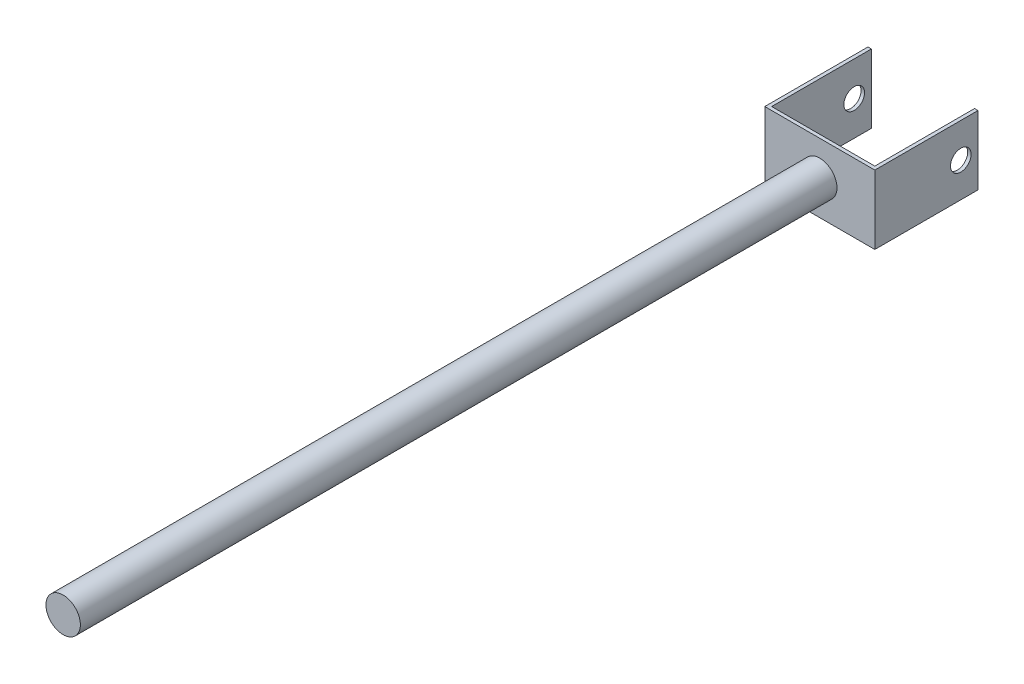
ISO-10303-21;
HEADER;
FILE_DESCRIPTION(('STEP AP214'),'2;1');
FILE_NAME('part.step','',(''),(''),'','','');
FILE_SCHEMA(('AUTOMOTIVE_DESIGN { 1 0 10303 214 1 1 1 1 }'));
ENDSEC;
DATA;
#1=APPLICATION_CONTEXT('core data for automotive mechanical design processes');
#2=APPLICATION_PROTOCOL_DEFINITION('international standard','automotive_design',2000,#1);
#3=PRODUCT_CONTEXT('',#1,'mechanical');
#4=PRODUCT('Part','Part','',(#3));
#5=PRODUCT_RELATED_PRODUCT_CATEGORY('part','',(#4));
#6=PRODUCT_DEFINITION_FORMATION('','',#4);
#7=PRODUCT_DEFINITION_CONTEXT('part definition',#1,'design');
#8=PRODUCT_DEFINITION('design','',#6,#7);
#9=PRODUCT_DEFINITION_SHAPE('','',#8);
#10=(LENGTH_UNIT() NAMED_UNIT(*) SI_UNIT(.MILLI.,.METRE.));
#11=(NAMED_UNIT(*) PLANE_ANGLE_UNIT() SI_UNIT($,.RADIAN.));
#12=(NAMED_UNIT(*) SI_UNIT($,.STERADIAN.) SOLID_ANGLE_UNIT());
#13=UNCERTAINTY_MEASURE_WITH_UNIT(LENGTH_MEASURE(1.E-05),#10,'distance_accuracy_value','');
#14=(GEOMETRIC_REPRESENTATION_CONTEXT(3) GLOBAL_UNCERTAINTY_ASSIGNED_CONTEXT((#13)) GLOBAL_UNIT_ASSIGNED_CONTEXT((#10,
#11,#12)) REPRESENTATION_CONTEXT('',''));
#15=CARTESIAN_POINT('',(0.,0.,0.));
#16=DIRECTION('',(0.,0.,1.));
#17=DIRECTION('',(1.,0.,0.));
#18=AXIS2_PLACEMENT_3D('',#15,#16,#17);
#19=CARTESIAN_POINT('',(0.,50.,0.));
#20=DIRECTION('',(1.,0.,0.));
#21=DIRECTION('',(0.,0.,-1.));
#22=AXIS2_PLACEMENT_3D('',#19,#20,#21);
#23=PLANE('',#22);
#24=CARTESIAN_POINT('',(0.,0.,-125.));
#25=DIRECTION('',(1.,0.,0.));
#26=DIRECTION('',(0.,0.,-1.));
#27=AXIS2_PLACEMENT_3D('',#24,#25,#26);
#28=CIRCLE('',#27,15.);
#29=CARTESIAN_POINT('',(0.,0.,-140.));
#30=VERTEX_POINT('',#29);
#31=EDGE_CURVE('E192',#30,#30,#28,.T.);
#32=ORIENTED_EDGE('',*,*,#31,.T.);
#33=EDGE_LOOP('',(#32));
#34=FACE_BOUND('',#33,.T.);
#35=DIRECTION('',(0.,0.,1.));
#36=VECTOR('',#35,1.);
#37=CARTESIAN_POINT('',(0.,-50.,0.));
#38=LINE('',#37,#36);
#39=CARTESIAN_POINT('',(0.,-50.,-150.));
#40=VERTEX_POINT('',#39);
#41=CARTESIAN_POINT('',(0.,-50.,0.));
#42=VERTEX_POINT('',#41);
#43=EDGE_CURVE('E132',#40,#42,#38,.T.);
#44=ORIENTED_EDGE('',*,*,#43,.T.);
#45=DIRECTION('',(0.,-1.,0.));
#46=VECTOR('',#45,1.);
#47=CARTESIAN_POINT('',(0.,50.,0.));
#48=LINE('',#47,#46);
#49=CARTESIAN_POINT('',(0.,50.,0.));
#50=VERTEX_POINT('',#49);
#51=EDGE_CURVE('E42',#50,#42,#48,.T.);
#52=ORIENTED_EDGE('',*,*,#51,.F.);
#53=DIRECTION('',(0.,0.,1.));
#54=VECTOR('',#53,1.);
#55=CARTESIAN_POINT('',(0.,50.,0.));
#56=LINE('',#55,#54);
#57=CARTESIAN_POINT('',(0.,50.,-150.));
#58=VERTEX_POINT('',#57);
#59=EDGE_CURVE('E147',#58,#50,#56,.T.);
#60=ORIENTED_EDGE('',*,*,#59,.F.);
#61=DIRECTION('',(0.,-1.,0.));
#62=VECTOR('',#61,1.);
#63=CARTESIAN_POINT('',(0.,50.,-150.));
#64=LINE('',#63,#62);
#65=EDGE_CURVE('E128',#58,#40,#64,.T.);
#66=ORIENTED_EDGE('',*,*,#65,.T.);
#67=EDGE_LOOP('',(#44,#52,#60,#66));
#68=FACE_BOUND('',#67,.T.);
#69=ADVANCED_FACE('F33',(#34,#68),#23,.F.);
#70=CARTESIAN_POINT('',(0.,50.,0.));
#71=DIRECTION('',(0.,0.,-1.));
#72=DIRECTION('',(-1.,0.,0.));
#73=AXIS2_PLACEMENT_3D('',#70,#71,#72);
#74=PLANE('',#73);
#75=CARTESIAN_POINT('',(80.,0.,0.));
#76=DIRECTION('',(0.,0.,1.));
#77=DIRECTION('',(1.,0.,0.));
#78=AXIS2_PLACEMENT_3D('',#75,#76,#77);
#79=CIRCLE('',#78,25.);
#80=CARTESIAN_POINT('',(105.,0.,0.));
#81=VERTEX_POINT('',#80);
#82=EDGE_CURVE('E11',#81,#81,#79,.T.);
#83=ORIENTED_EDGE('',*,*,#82,.F.);
#84=EDGE_LOOP('',(#83));
#85=FACE_BOUND('',#84,.T.);
#86=DIRECTION('',(1.,0.,0.));
#87=VECTOR('',#86,1.);
#88=CARTESIAN_POINT('',(0.,-50.,0.));
#89=LINE('',#88,#87);
#90=CARTESIAN_POINT('',(160.,-50.,0.));
#91=VERTEX_POINT('',#90);
#92=EDGE_CURVE('E135',#42,#91,#89,.T.);
#93=ORIENTED_EDGE('',*,*,#92,.T.);
#94=DIRECTION('',(0.,-1.,0.));
#95=VECTOR('',#94,1.);
#96=CARTESIAN_POINT('',(160.,50.,0.));
#97=LINE('',#96,#95);
#98=CARTESIAN_POINT('',(160.,50.,0.));
#99=VERTEX_POINT('',#98);
#100=EDGE_CURVE('E157',#99,#91,#97,.T.);
#101=ORIENTED_EDGE('',*,*,#100,.F.);
#102=DIRECTION('',(1.,0.,0.));
#103=VECTOR('',#102,1.);
#104=CARTESIAN_POINT('',(0.,50.,0.));
#105=LINE('',#104,#103);
#106=EDGE_CURVE('E95',#50,#99,#105,.T.);
#107=ORIENTED_EDGE('',*,*,#106,.F.);
#108=ORIENTED_EDGE('',*,*,#51,.T.);
#109=EDGE_LOOP('',(#93,#101,#107,#108));
#110=FACE_BOUND('',#109,.T.);
#111=ADVANCED_FACE('F160',(#85,#110),#74,.F.);
#112=CARTESIAN_POINT('',(160.,50.,0.));
#113=DIRECTION('',(-1.,0.,0.));
#114=DIRECTION('',(0.,0.,1.));
#115=AXIS2_PLACEMENT_3D('',#112,#113,#114);
#116=PLANE('',#115);
#117=CARTESIAN_POINT('',(160.,0.,-125.));
#118=DIRECTION('',(1.,0.,0.));
#119=DIRECTION('',(0.,0.,-1.));
#120=AXIS2_PLACEMENT_3D('',#117,#118,#119);
#121=CIRCLE('',#120,15.);
#122=CARTESIAN_POINT('',(160.,0.,-140.));
#123=VERTEX_POINT('',#122);
#124=EDGE_CURVE('E189',#123,#123,#121,.T.);
#125=ORIENTED_EDGE('',*,*,#124,.F.);
#126=EDGE_LOOP('',(#125));
#127=FACE_BOUND('',#126,.T.);
#128=DIRECTION('',(0.,0.,-1.));
#129=VECTOR('',#128,1.);
#130=CARTESIAN_POINT('',(160.,-50.,0.));
#131=LINE('',#130,#129);
#132=CARTESIAN_POINT('',(160.,-50.,-150.));
#133=VERTEX_POINT('',#132);
#134=EDGE_CURVE('E138',#91,#133,#131,.T.);
#135=ORIENTED_EDGE('',*,*,#134,.T.);
#136=DIRECTION('',(0.,-1.,0.));
#137=VECTOR('',#136,1.);
#138=CARTESIAN_POINT('',(160.,50.,-150.));
#139=LINE('',#138,#137);
#140=CARTESIAN_POINT('',(160.,50.,-150.));
#141=VERTEX_POINT('',#140);
#142=EDGE_CURVE('E154',#141,#133,#139,.T.);
#143=ORIENTED_EDGE('',*,*,#142,.F.);
#144=DIRECTION('',(0.,0.,-1.));
#145=VECTOR('',#144,1.);
#146=CARTESIAN_POINT('',(160.,50.,0.));
#147=LINE('',#146,#145);
#148=EDGE_CURVE('E178',#99,#141,#147,.T.);
#149=ORIENTED_EDGE('',*,*,#148,.F.);
#150=ORIENTED_EDGE('',*,*,#100,.T.);
#151=EDGE_LOOP('',(#135,#143,#149,#150));
#152=FACE_BOUND('',#151,.T.);
#153=ADVANCED_FACE('F171',(#127,#152),#116,.F.);
#154=CARTESIAN_POINT('',(155.,50.,-150.));
#155=DIRECTION('',(0.,0.,1.));
#156=DIRECTION('',(1.,0.,0.));
#157=AXIS2_PLACEMENT_3D('',#154,#155,#156);
#158=PLANE('',#157);
#159=DIRECTION('',(-1.,0.,0.));
#160=VECTOR('',#159,1.);
#161=CARTESIAN_POINT('',(155.,-50.,-150.));
#162=LINE('',#161,#160);
#163=CARTESIAN_POINT('',(155.,-50.,-150.));
#164=VERTEX_POINT('',#163);
#165=EDGE_CURVE('E140',#133,#164,#162,.T.);
#166=ORIENTED_EDGE('',*,*,#165,.T.);
#167=DIRECTION('',(0.,-1.,0.));
#168=VECTOR('',#167,1.);
#169=CARTESIAN_POINT('',(155.,50.,-150.));
#170=LINE('',#169,#168);
#171=CARTESIAN_POINT('',(155.,50.,-150.));
#172=VERTEX_POINT('',#171);
#173=EDGE_CURVE('E151',#172,#164,#170,.T.);
#174=ORIENTED_EDGE('',*,*,#173,.F.);
#175=DIRECTION('',(-1.,0.,0.));
#176=VECTOR('',#175,1.);
#177=CARTESIAN_POINT('',(155.,50.,-150.));
#178=LINE('',#177,#176);
#179=EDGE_CURVE('E177',#141,#172,#178,.T.);
#180=ORIENTED_EDGE('',*,*,#179,.F.);
#181=ORIENTED_EDGE('',*,*,#142,.T.);
#182=EDGE_LOOP('',(#166,#174,#180,#181));
#183=FACE_BOUND('',#182,.T.);
#184=ADVANCED_FACE('F175',(#183),#158,.F.);
#185=CARTESIAN_POINT('',(155.,50.,-5.));
#186=DIRECTION('',(1.,0.,0.));
#187=DIRECTION('',(0.,0.,-1.));
#188=AXIS2_PLACEMENT_3D('',#185,#186,#187);
#189=PLANE('',#188);
#190=CARTESIAN_POINT('',(155.,0.,-125.));
#191=DIRECTION('',(1.,0.,0.));
#192=DIRECTION('',(0.,0.,-1.));
#193=AXIS2_PLACEMENT_3D('',#190,#191,#192);
#194=CIRCLE('',#193,15.);
#195=CARTESIAN_POINT('',(155.,0.,-140.));
#196=VERTEX_POINT('',#195);
#197=EDGE_CURVE('E186',#196,#196,#194,.T.);
#198=ORIENTED_EDGE('',*,*,#197,.T.);
#199=EDGE_LOOP('',(#198));
#200=FACE_BOUND('',#199,.T.);
#201=DIRECTION('',(0.,0.,1.));
#202=VECTOR('',#201,1.);
#203=CARTESIAN_POINT('',(155.,-50.,-5.));
#204=LINE('',#203,#202);
#205=CARTESIAN_POINT('',(155.,-50.,-5.));
#206=VERTEX_POINT('',#205);
#207=EDGE_CURVE('E142',#164,#206,#204,.T.);
#208=ORIENTED_EDGE('',*,*,#207,.T.);
#209=DIRECTION('',(0.,-1.,0.));
#210=VECTOR('',#209,1.);
#211=CARTESIAN_POINT('',(155.,50.,-5.));
#212=LINE('',#211,#210);
#213=CARTESIAN_POINT('',(155.,50.,-5.));
#214=VERTEX_POINT('',#213);
#215=EDGE_CURVE('E123',#214,#206,#212,.T.);
#216=ORIENTED_EDGE('',*,*,#215,.F.);
#217=DIRECTION('',(0.,0.,1.));
#218=VECTOR('',#217,1.);
#219=CARTESIAN_POINT('',(155.,50.,-5.));
#220=LINE('',#219,#218);
#221=EDGE_CURVE('E114',#172,#214,#220,.T.);
#222=ORIENTED_EDGE('',*,*,#221,.F.);
#223=ORIENTED_EDGE('',*,*,#173,.T.);
#224=EDGE_LOOP('',(#208,#216,#222,#223));
#225=FACE_BOUND('',#224,.T.);
#226=ADVANCED_FACE('F228',(#200,#225),#189,.F.);
#227=CARTESIAN_POINT('',(5.00000000000002,50.,-5.));
#228=DIRECTION('',(0.,0.,1.));
#229=DIRECTION('',(1.,0.,0.));
#230=AXIS2_PLACEMENT_3D('',#227,#228,#229);
#231=PLANE('',#230);
#232=DIRECTION('',(-1.,0.,0.));
#233=VECTOR('',#232,1.);
#234=CARTESIAN_POINT('',(5.00000000000002,-50.,-5.));
#235=LINE('',#234,#233);
#236=CARTESIAN_POINT('',(5.00000000000002,-50.,-5.));
#237=VERTEX_POINT('',#236);
#238=EDGE_CURVE('E122',#206,#237,#235,.T.);
#239=ORIENTED_EDGE('',*,*,#238,.T.);
#240=DIRECTION('',(0.,-1.,0.));
#241=VECTOR('',#240,1.);
#242=CARTESIAN_POINT('',(5.00000000000002,50.,-5.));
#243=LINE('',#242,#241);
#244=CARTESIAN_POINT('',(5.00000000000002,50.,-5.));
#245=VERTEX_POINT('',#244);
#246=EDGE_CURVE('E119',#245,#237,#243,.T.);
#247=ORIENTED_EDGE('',*,*,#246,.F.);
#248=DIRECTION('',(-1.,0.,0.));
#249=VECTOR('',#248,1.);
#250=CARTESIAN_POINT('',(5.00000000000002,50.,-5.));
#251=LINE('',#250,#249);
#252=EDGE_CURVE('E108',#214,#245,#251,.T.);
#253=ORIENTED_EDGE('',*,*,#252,.F.);
#254=ORIENTED_EDGE('',*,*,#215,.T.);
#255=EDGE_LOOP('',(#239,#247,#253,#254));
#256=FACE_BOUND('',#255,.T.);
#257=ADVANCED_FACE('F120',(#256),#231,.F.);
#258=CARTESIAN_POINT('',(5.,50.,-150.));
#259=DIRECTION('',(-1.,0.,0.));
#260=DIRECTION('',(0.,0.,1.));
#261=AXIS2_PLACEMENT_3D('',#258,#259,#260);
#262=PLANE('',#261);
#263=CARTESIAN_POINT('',(5.,0.,-125.));
#264=DIRECTION('',(-1.,0.,0.));
#265=DIRECTION('',(0.,0.,1.));
#266=AXIS2_PLACEMENT_3D('',#263,#264,#265);
#267=CIRCLE('',#266,15.);
#268=CARTESIAN_POINT('',(5.00000000000001,0.,-110.));
#269=VERTEX_POINT('',#268);
#270=EDGE_CURVE('E36',#269,#269,#267,.T.);
#271=ORIENTED_EDGE('',*,*,#270,.T.);
#272=EDGE_LOOP('',(#271));
#273=FACE_BOUND('',#272,.T.);
#274=DIRECTION('',(0.,0.,-1.));
#275=VECTOR('',#274,1.);
#276=CARTESIAN_POINT('',(5.,-50.,-150.));
#277=LINE('',#276,#275);
#278=CARTESIAN_POINT('',(5.,-50.,-150.));
#279=VERTEX_POINT('',#278);
#280=EDGE_CURVE('E80',#237,#279,#277,.T.);
#281=ORIENTED_EDGE('',*,*,#280,.T.);
#282=DIRECTION('',(0.,-1.,0.));
#283=VECTOR('',#282,1.);
#284=CARTESIAN_POINT('',(5.,50.,-150.));
#285=LINE('',#284,#283);
#286=CARTESIAN_POINT('',(5.,50.,-150.));
#287=VERTEX_POINT('',#286);
#288=EDGE_CURVE('E124',#287,#279,#285,.T.);
#289=ORIENTED_EDGE('',*,*,#288,.F.);
#290=DIRECTION('',(0.,0.,-1.));
#291=VECTOR('',#290,1.);
#292=CARTESIAN_POINT('',(5.,50.,-150.));
#293=LINE('',#292,#291);
#294=EDGE_CURVE('E112',#245,#287,#293,.T.);
#295=ORIENTED_EDGE('',*,*,#294,.F.);
#296=ORIENTED_EDGE('',*,*,#246,.T.);
#297=EDGE_LOOP('',(#281,#289,#295,#296));
#298=FACE_BOUND('',#297,.T.);
#299=ADVANCED_FACE('F126',(#273,#298),#262,.F.);
#300=CARTESIAN_POINT('',(0.,50.,-150.));
#301=DIRECTION('',(0.,0.,1.));
#302=DIRECTION('',(1.,0.,0.));
#303=AXIS2_PLACEMENT_3D('',#300,#301,#302);
#304=PLANE('',#303);
#305=DIRECTION('',(-1.,0.,0.));
#306=VECTOR('',#305,1.);
#307=CARTESIAN_POINT('',(0.,-50.,-150.));
#308=LINE('',#307,#306);
#309=EDGE_CURVE('E86',#279,#40,#308,.T.);
#310=ORIENTED_EDGE('',*,*,#309,.T.);
#311=ORIENTED_EDGE('',*,*,#65,.F.);
#312=DIRECTION('',(-1.,0.,0.));
#313=VECTOR('',#312,1.);
#314=CARTESIAN_POINT('',(0.,50.,-150.));
#315=LINE('',#314,#313);
#316=EDGE_CURVE('E51',#287,#58,#315,.T.);
#317=ORIENTED_EDGE('',*,*,#316,.F.);
#318=ORIENTED_EDGE('',*,*,#288,.T.);
#319=EDGE_LOOP('',(#310,#311,#317,#318));
#320=FACE_BOUND('',#319,.T.);
#321=ADVANCED_FACE('F236',(#320),#304,.F.);
#322=CARTESIAN_POINT('',(0.,50.,0.));
#323=DIRECTION('',(0.,-1.,0.));
#324=DIRECTION('',(0.,0.,-1.));
#325=AXIS2_PLACEMENT_3D('',#322,#323,#324);
#326=PLANE('',#325);
#327=ORIENTED_EDGE('',*,*,#59,.T.);
#328=ORIENTED_EDGE('',*,*,#106,.T.);
#329=ORIENTED_EDGE('',*,*,#148,.T.);
#330=ORIENTED_EDGE('',*,*,#179,.T.);
#331=ORIENTED_EDGE('',*,*,#221,.T.);
#332=ORIENTED_EDGE('',*,*,#252,.T.);
#333=ORIENTED_EDGE('',*,*,#294,.T.);
#334=ORIENTED_EDGE('',*,*,#316,.T.);
#335=EDGE_LOOP('',(#327,#328,#329,#330,#331,#332,#333,#334));
#336=FACE_BOUND('',#335,.T.);
#337=ADVANCED_FACE('F110',(#336),#326,.F.);
#338=CARTESIAN_POINT('',(0.,-50.,0.));
#339=DIRECTION('',(0.,-1.,0.));
#340=DIRECTION('',(0.,0.,-1.));
#341=AXIS2_PLACEMENT_3D('',#338,#339,#340);
#342=PLANE('',#341);
#343=ORIENTED_EDGE('',*,*,#43,.F.);
#344=ORIENTED_EDGE('',*,*,#309,.F.);
#345=ORIENTED_EDGE('',*,*,#280,.F.);
#346=ORIENTED_EDGE('',*,*,#238,.F.);
#347=ORIENTED_EDGE('',*,*,#207,.F.);
#348=ORIENTED_EDGE('',*,*,#165,.F.);
#349=ORIENTED_EDGE('',*,*,#134,.F.);
#350=ORIENTED_EDGE('',*,*,#92,.F.);
#351=EDGE_LOOP('',(#343,#344,#345,#346,#347,#348,#349,#350));
#352=FACE_BOUND('',#351,.T.);
#353=ADVANCED_FACE('F165',(#352),#342,.T.);
#354=CARTESIAN_POINT('',(80.,0.,1100.));
#355=DIRECTION('',(0.,0.,-1.));
#356=DIRECTION('',(-1.,0.,0.));
#357=AXIS2_PLACEMENT_3D('',#354,#355,#356);
#358=CYLINDRICAL_SURFACE('',#357,25.);
#359=CARTESIAN_POINT('',(80.,0.,1100.));
#360=DIRECTION('',(0.,0.,1.));
#361=DIRECTION('',(1.,0.,0.));
#362=AXIS2_PLACEMENT_3D('',#359,#360,#361);
#363=CIRCLE('',#362,25.);
#364=CARTESIAN_POINT('',(105.,0.,1100.));
#365=VERTEX_POINT('',#364);
#366=EDGE_CURVE('E136',#365,#365,#363,.T.);
#367=ORIENTED_EDGE('',*,*,#366,.F.);
#368=EDGE_LOOP('',(#367));
#369=FACE_BOUND('',#368,.T.);
#370=ORIENTED_EDGE('',*,*,#82,.T.);
#371=EDGE_LOOP('',(#370));
#372=FACE_BOUND('',#371,.T.);
#373=ADVANCED_FACE('F211',(#369,#372),#358,.T.);
#374=CARTESIAN_POINT('',(80.,0.,1100.));
#375=DIRECTION('',(0.,0.,1.));
#376=DIRECTION('',(1.,0.,0.));
#377=AXIS2_PLACEMENT_3D('',#374,#375,#376);
#378=PLANE('',#377);
#379=ORIENTED_EDGE('',*,*,#366,.T.);
#380=EDGE_LOOP('',(#379));
#381=FACE_BOUND('',#380,.T.);
#382=ADVANCED_FACE('F203',(#381),#378,.T.);
#383=CARTESIAN_POINT('',(0.,0.,-125.));
#384=DIRECTION('',(1.,0.,0.));
#385=DIRECTION('',(0.,0.,-1.));
#386=AXIS2_PLACEMENT_3D('',#383,#384,#385);
#387=CYLINDRICAL_SURFACE('',#386,15.);
#388=ORIENTED_EDGE('',*,*,#31,.F.);
#389=EDGE_LOOP('',(#388));
#390=FACE_BOUND('',#389,.T.);
#391=ORIENTED_EDGE('',*,*,#270,.F.);
#392=EDGE_LOOP('',(#391));
#393=FACE_BOUND('',#392,.T.);
#394=ADVANCED_FACE('F200',(#390,#393),#387,.F.);
#395=ORIENTED_EDGE('',*,*,#124,.T.);
#396=EDGE_LOOP('',(#395));
#397=FACE_BOUND('',#396,.T.);
#398=ORIENTED_EDGE('',*,*,#197,.F.);
#399=EDGE_LOOP('',(#398));
#400=FACE_BOUND('',#399,.T.);
#401=ADVANCED_FACE('F202',(#397,#400),#387,.F.);
#402=CLOSED_SHELL('',(#69,#111,#153,#184,#226,#257,#299,#321,#337,#353,#373,#382,#394,#401));
#403=MANIFOLD_SOLID_BREP('B2',#402);
#404=ADVANCED_BREP_SHAPE_REPRESENTATION('',(#18,#403),#14);
#405=SHAPE_DEFINITION_REPRESENTATION(#9,#404);
ENDSEC;
END-ISO-10303-21;
